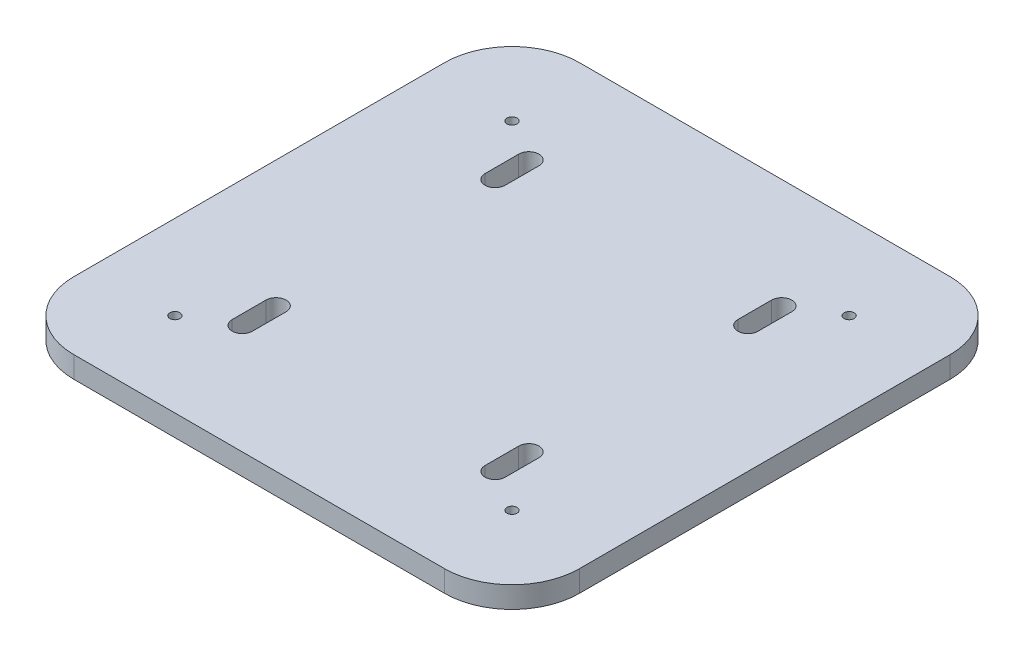
ISO-10303-21;
HEADER;
FILE_DESCRIPTION(('STEP AP214'),'2;1');
FILE_NAME('part.step','',(''),(''),'','','');
FILE_SCHEMA(('AUTOMOTIVE_DESIGN { 1 0 10303 214 1 1 1 1 }'));
ENDSEC;
DATA;
#1=APPLICATION_CONTEXT('core data for automotive mechanical design processes');
#2=APPLICATION_PROTOCOL_DEFINITION('international standard','automotive_design',2000,#1);
#3=PRODUCT_CONTEXT('',#1,'mechanical');
#4=PRODUCT('Part','Part','',(#3));
#5=PRODUCT_RELATED_PRODUCT_CATEGORY('part','',(#4));
#6=PRODUCT_DEFINITION_FORMATION('','',#4);
#7=PRODUCT_DEFINITION_CONTEXT('part definition',#1,'design');
#8=PRODUCT_DEFINITION('design','',#6,#7);
#9=PRODUCT_DEFINITION_SHAPE('','',#8);
#10=(LENGTH_UNIT() NAMED_UNIT(*) SI_UNIT(.MILLI.,.METRE.));
#11=(NAMED_UNIT(*) PLANE_ANGLE_UNIT() SI_UNIT($,.RADIAN.));
#12=(NAMED_UNIT(*) SI_UNIT($,.STERADIAN.) SOLID_ANGLE_UNIT());
#13=UNCERTAINTY_MEASURE_WITH_UNIT(LENGTH_MEASURE(1.E-05),#10,'distance_accuracy_value','');
#14=(GEOMETRIC_REPRESENTATION_CONTEXT(3) GLOBAL_UNCERTAINTY_ASSIGNED_CONTEXT((#13)) GLOBAL_UNIT_ASSIGNED_CONTEXT((#10,
#11,#12)) REPRESENTATION_CONTEXT('',''));
#15=CARTESIAN_POINT('',(0.,0.,0.));
#16=DIRECTION('',(0.,0.,1.));
#17=DIRECTION('',(1.,0.,0.));
#18=AXIS2_PLACEMENT_3D('',#15,#16,#17);
#19=CARTESIAN_POINT('',(55.,6.35,-55.));
#20=DIRECTION('',(0.,1.,0.));
#21=DIRECTION('',(0.,0.,1.));
#22=AXIS2_PLACEMENT_3D('',#19,#20,#21);
#23=PLANE('',#22);
#24=CARTESIAN_POINT('',(-37.5,6.35,42.5));
#25=DIRECTION('',(0.,1.,0.));
#26=DIRECTION('',(0.,0.,-1.));
#27=AXIS2_PLACEMENT_3D('',#24,#25,#26);
#28=CIRCLE('',#27,3.00000000000001);
#29=CARTESIAN_POINT('',(-40.5,6.35,42.5));
#30=VERTEX_POINT('',#29);
#31=CARTESIAN_POINT('',(-34.5,6.35,42.5));
#32=VERTEX_POINT('',#31);
#33=EDGE_CURVE('E48',#30,#32,#28,.T.);
#34=ORIENTED_EDGE('',*,*,#33,.F.);
#35=DIRECTION('',(0.,0.,1.));
#36=VECTOR('',#35,1.);
#37=CARTESIAN_POINT('',(-40.5,6.35,42.5));
#38=LINE('',#37,#36);
#39=CARTESIAN_POINT('',(-40.5,6.35,32.5));
#40=VERTEX_POINT('',#39);
#41=EDGE_CURVE('E257',#40,#30,#38,.T.);
#42=ORIENTED_EDGE('',*,*,#41,.F.);
#43=CARTESIAN_POINT('',(-37.5,6.35,32.5));
#44=DIRECTION('',(0.,1.,0.));
#45=DIRECTION('',(0.,0.,-1.));
#46=AXIS2_PLACEMENT_3D('',#43,#44,#45);
#47=CIRCLE('',#46,3.00000000000001);
#48=CARTESIAN_POINT('',(-34.5,6.35,32.5));
#49=VERTEX_POINT('',#48);
#50=EDGE_CURVE('E254',#49,#40,#47,.T.);
#51=ORIENTED_EDGE('',*,*,#50,.F.);
#52=DIRECTION('',(0.,0.,-1.));
#53=VECTOR('',#52,1.);
#54=CARTESIAN_POINT('',(-34.5,6.35,42.5));
#55=LINE('',#54,#53);
#56=EDGE_CURVE('E251',#32,#49,#55,.T.);
#57=ORIENTED_EDGE('',*,*,#56,.F.);
#58=EDGE_LOOP('',(#34,#42,#51,#57));
#59=FACE_BOUND('',#58,.T.);
#60=CARTESIAN_POINT('',(37.5,6.35,32.5));
#61=DIRECTION('',(0.,1.,0.));
#62=DIRECTION('',(0.,0.,1.));
#63=AXIS2_PLACEMENT_3D('',#60,#61,#62);
#64=CIRCLE('',#63,3.00000000000001);
#65=CARTESIAN_POINT('',(40.5,6.35,32.5));
#66=VERTEX_POINT('',#65);
#67=CARTESIAN_POINT('',(34.5,6.35,32.5));
#68=VERTEX_POINT('',#67);
#69=EDGE_CURVE('E56',#66,#68,#64,.T.);
#70=ORIENTED_EDGE('',*,*,#69,.F.);
#71=DIRECTION('',(0.,0.,-1.));
#72=VECTOR('',#71,1.);
#73=CARTESIAN_POINT('',(40.5,6.35,42.5));
#74=LINE('',#73,#72);
#75=CARTESIAN_POINT('',(40.5,6.35,42.5));
#76=VERTEX_POINT('',#75);
#77=EDGE_CURVE('E239',#76,#66,#74,.T.);
#78=ORIENTED_EDGE('',*,*,#77,.F.);
#79=CARTESIAN_POINT('',(37.5,6.35,42.5));
#80=DIRECTION('',(0.,1.,0.));
#81=DIRECTION('',(0.,0.,1.));
#82=AXIS2_PLACEMENT_3D('',#79,#80,#81);
#83=CIRCLE('',#82,3.00000000000001);
#84=CARTESIAN_POINT('',(34.5,6.35,42.5));
#85=VERTEX_POINT('',#84);
#86=EDGE_CURVE('E236',#85,#76,#83,.T.);
#87=ORIENTED_EDGE('',*,*,#86,.F.);
#88=DIRECTION('',(0.,0.,1.));
#89=VECTOR('',#88,1.);
#90=CARTESIAN_POINT('',(34.5,6.35,42.5));
#91=LINE('',#90,#89);
#92=EDGE_CURVE('E232',#68,#85,#91,.T.);
#93=ORIENTED_EDGE('',*,*,#92,.F.);
#94=EDGE_LOOP('',(#70,#78,#87,#93));
#95=FACE_BOUND('',#94,.T.);
#96=CARTESIAN_POINT('',(37.5,6.35,-42.5));
#97=DIRECTION('',(0.,1.,0.));
#98=DIRECTION('',(0.,0.,-1.));
#99=AXIS2_PLACEMENT_3D('',#96,#97,#98);
#100=CIRCLE('',#99,3.00000000000001);
#101=CARTESIAN_POINT('',(40.5,6.35,-42.5));
#102=VERTEX_POINT('',#101);
#103=CARTESIAN_POINT('',(34.5,6.35,-42.5));
#104=VERTEX_POINT('',#103);
#105=EDGE_CURVE('E217',#102,#104,#100,.T.);
#106=ORIENTED_EDGE('',*,*,#105,.F.);
#107=DIRECTION('',(0.,0.,-1.));
#108=VECTOR('',#107,1.);
#109=CARTESIAN_POINT('',(40.5,6.35,-42.5));
#110=LINE('',#109,#108);
#111=CARTESIAN_POINT('',(40.5,6.35,-32.5));
#112=VERTEX_POINT('',#111);
#113=EDGE_CURVE('E221',#112,#102,#110,.T.);
#114=ORIENTED_EDGE('',*,*,#113,.F.);
#115=CARTESIAN_POINT('',(37.5,6.35,-32.5));
#116=DIRECTION('',(0.,1.,0.));
#117=DIRECTION('',(0.,0.,-1.));
#118=AXIS2_PLACEMENT_3D('',#115,#116,#117);
#119=CIRCLE('',#118,3.00000000000001);
#120=CARTESIAN_POINT('',(34.5,6.35,-32.5));
#121=VERTEX_POINT('',#120);
#122=EDGE_CURVE('E201',#121,#112,#119,.T.);
#123=ORIENTED_EDGE('',*,*,#122,.F.);
#124=DIRECTION('',(0.,0.,1.));
#125=VECTOR('',#124,1.);
#126=CARTESIAN_POINT('',(34.5,6.35,-42.5));
#127=LINE('',#126,#125);
#128=EDGE_CURVE('E212',#104,#121,#127,.T.);
#129=ORIENTED_EDGE('',*,*,#128,.F.);
#130=EDGE_LOOP('',(#106,#114,#123,#129));
#131=FACE_BOUND('',#130,.T.);
#132=CARTESIAN_POINT('',(-37.5,6.35,-42.5));
#133=DIRECTION('',(0.,1.,0.));
#134=DIRECTION('',(0.,0.,1.));
#135=AXIS2_PLACEMENT_3D('',#132,#133,#134);
#136=CIRCLE('',#135,3.00000000000001);
#137=CARTESIAN_POINT('',(-34.5,6.35,-42.5));
#138=VERTEX_POINT('',#137);
#139=CARTESIAN_POINT('',(-40.5,6.35,-42.5));
#140=VERTEX_POINT('',#139);
#141=EDGE_CURVE('E228',#138,#140,#136,.T.);
#142=ORIENTED_EDGE('',*,*,#141,.F.);
#143=DIRECTION('',(0.,0.,-1.));
#144=VECTOR('',#143,1.);
#145=CARTESIAN_POINT('',(-34.5,6.35,-42.5));
#146=LINE('',#145,#144);
#147=CARTESIAN_POINT('',(-34.5,6.35,-32.5));
#148=VERTEX_POINT('',#147);
#149=EDGE_CURVE('E274',#148,#138,#146,.T.);
#150=ORIENTED_EDGE('',*,*,#149,.F.);
#151=CARTESIAN_POINT('',(-37.5,6.35,-32.5));
#152=DIRECTION('',(0.,1.,0.));
#153=DIRECTION('',(0.,0.,1.));
#154=AXIS2_PLACEMENT_3D('',#151,#152,#153);
#155=CIRCLE('',#154,3.00000000000001);
#156=CARTESIAN_POINT('',(-40.5,6.35,-32.5));
#157=VERTEX_POINT('',#156);
#158=EDGE_CURVE('E271',#157,#148,#155,.T.);
#159=ORIENTED_EDGE('',*,*,#158,.F.);
#160=DIRECTION('',(0.,0.,1.));
#161=VECTOR('',#160,1.);
#162=CARTESIAN_POINT('',(-40.5,6.35,-42.5));
#163=LINE('',#162,#161);
#164=EDGE_CURVE('E268',#140,#157,#163,.T.);
#165=ORIENTED_EDGE('',*,*,#164,.F.);
#166=EDGE_LOOP('',(#142,#150,#159,#165));
#167=FACE_BOUND('',#166,.T.);
#168=CARTESIAN_POINT('',(-49.9999999999972,6.35,50.0000000000028));
#169=DIRECTION('',(0.,1.,0.));
#170=DIRECTION('',(0.,0.,1.));
#171=AXIS2_PLACEMENT_3D('',#168,#169,#170);
#172=CIRCLE('',#171,1.5000000000021);
#173=CARTESIAN_POINT('',(-49.9999999999972,6.35,51.5000000000049));
#174=VERTEX_POINT('',#173);
#175=EDGE_CURVE('E293',#174,#174,#172,.T.);
#176=ORIENTED_EDGE('',*,*,#175,.F.);
#177=EDGE_LOOP('',(#176));
#178=FACE_BOUND('',#177,.T.);
#179=CARTESIAN_POINT('',(50.,6.35,-50.));
#180=DIRECTION('',(0.,1.,0.));
#181=DIRECTION('',(0.,0.,1.));
#182=AXIS2_PLACEMENT_3D('',#179,#180,#181);
#183=CIRCLE('',#182,1.5);
#184=CARTESIAN_POINT('',(50.,6.35,-48.5));
#185=VERTEX_POINT('',#184);
#186=EDGE_CURVE('E305',#185,#185,#183,.T.);
#187=ORIENTED_EDGE('',*,*,#186,.F.);
#188=EDGE_LOOP('',(#187));
#189=FACE_BOUND('',#188,.T.);
#190=CARTESIAN_POINT('',(55.,6.35,-55.));
#191=DIRECTION('',(0.,1.,0.));
#192=DIRECTION('',(0.,0.,1.));
#193=AXIS2_PLACEMENT_3D('',#190,#191,#192);
#194=CIRCLE('',#193,20.);
#195=CARTESIAN_POINT('',(75.,6.35,-54.9999999999999));
#196=VERTEX_POINT('',#195);
#197=CARTESIAN_POINT('',(54.9999999999998,6.35,-75.));
#198=VERTEX_POINT('',#197);
#199=EDGE_CURVE('E311',#196,#198,#194,.T.);
#200=ORIENTED_EDGE('',*,*,#199,.T.);
#201=DIRECTION('',(-1.,0.,0.));
#202=VECTOR('',#201,1.);
#203=CARTESIAN_POINT('',(-54.9999999999998,6.35,-75.));
#204=LINE('',#203,#202);
#205=CARTESIAN_POINT('',(-55.,6.35,-75.));
#206=VERTEX_POINT('',#205);
#207=EDGE_CURVE('E314',#198,#206,#204,.T.);
#208=ORIENTED_EDGE('',*,*,#207,.T.);
#209=CARTESIAN_POINT('',(-55.,6.35,-55.));
#210=DIRECTION('',(0.,1.,0.));
#211=DIRECTION('',(0.,0.,-1.));
#212=AXIS2_PLACEMENT_3D('',#209,#210,#211);
#213=CIRCLE('',#212,20.);
#214=CARTESIAN_POINT('',(-75.,6.35,-54.9999999999999));
#215=VERTEX_POINT('',#214);
#216=EDGE_CURVE('E317',#206,#215,#213,.T.);
#217=ORIENTED_EDGE('',*,*,#216,.T.);
#218=DIRECTION('',(0.,0.,1.));
#219=VECTOR('',#218,1.);
#220=CARTESIAN_POINT('',(-75.,6.35,-54.9999999999999));
#221=LINE('',#220,#219);
#222=CARTESIAN_POINT('',(-75.,6.35,54.9999999999999));
#223=VERTEX_POINT('',#222);
#224=EDGE_CURVE('E319',#215,#223,#221,.T.);
#225=ORIENTED_EDGE('',*,*,#224,.T.);
#226=CARTESIAN_POINT('',(-55.,6.35,55.));
#227=DIRECTION('',(0.,1.,0.));
#228=DIRECTION('',(0.,0.,1.));
#229=AXIS2_PLACEMENT_3D('',#226,#227,#228);
#230=CIRCLE('',#229,20.);
#231=CARTESIAN_POINT('',(-54.9999999999998,6.35,75.));
#232=VERTEX_POINT('',#231);
#233=EDGE_CURVE('E321',#223,#232,#230,.T.);
#234=ORIENTED_EDGE('',*,*,#233,.T.);
#235=DIRECTION('',(1.,0.,0.));
#236=VECTOR('',#235,1.);
#237=CARTESIAN_POINT('',(-54.9999999999998,6.35,75.));
#238=LINE('',#237,#236);
#239=CARTESIAN_POINT('',(54.9999999999999,6.35,75.));
#240=VERTEX_POINT('',#239);
#241=EDGE_CURVE('E323',#232,#240,#238,.T.);
#242=ORIENTED_EDGE('',*,*,#241,.T.);
#243=CARTESIAN_POINT('',(55.,6.35,55.));
#244=DIRECTION('',(0.,1.,0.));
#245=DIRECTION('',(0.,0.,-1.));
#246=AXIS2_PLACEMENT_3D('',#243,#244,#245);
#247=CIRCLE('',#246,20.);
#248=CARTESIAN_POINT('',(75.,6.35,54.9999999999999));
#249=VERTEX_POINT('',#248);
#250=EDGE_CURVE('E325',#240,#249,#247,.T.);
#251=ORIENTED_EDGE('',*,*,#250,.T.);
#252=DIRECTION('',(0.,0.,-1.));
#253=VECTOR('',#252,1.);
#254=CARTESIAN_POINT('',(75.,6.35,-54.9999999999999));
#255=LINE('',#254,#253);
#256=EDGE_CURVE('E327',#249,#196,#255,.T.);
#257=ORIENTED_EDGE('',*,*,#256,.T.);
#258=EDGE_LOOP('',(#200,#208,#217,#225,#234,#242,#251,#257));
#259=FACE_BOUND('',#258,.T.);
#260=CARTESIAN_POINT('',(50.0000000000028,6.35,50.));
#261=DIRECTION('',(0.,1.,0.));
#262=DIRECTION('',(0.,0.,1.));
#263=AXIS2_PLACEMENT_3D('',#260,#261,#262);
#264=CIRCLE('',#263,1.49999999999931);
#265=CARTESIAN_POINT('',(50.0000000000028,6.35,51.4999999999993));
#266=VERTEX_POINT('',#265);
#267=EDGE_CURVE('E299',#266,#266,#264,.T.);
#268=ORIENTED_EDGE('',*,*,#267,.F.);
#269=EDGE_LOOP('',(#268));
#270=FACE_BOUND('',#269,.T.);
#271=CARTESIAN_POINT('',(-50.,6.35,-49.9999999999972));
#272=DIRECTION('',(0.,1.,0.));
#273=DIRECTION('',(0.,0.,1.));
#274=AXIS2_PLACEMENT_3D('',#271,#272,#273);
#275=CIRCLE('',#274,1.50000000000302);
#276=CARTESIAN_POINT('',(-50.,6.35,-48.4999999999942));
#277=VERTEX_POINT('',#276);
#278=EDGE_CURVE('E287',#277,#277,#275,.T.);
#279=ORIENTED_EDGE('',*,*,#278,.F.);
#280=EDGE_LOOP('',(#279));
#281=FACE_BOUND('',#280,.T.);
#282=ADVANCED_FACE('F33',(#59,#95,#131,#167,#178,#189,#259,#270,#281),#23,.T.);
#283=CARTESIAN_POINT('',(55.,0.,-55.));
#284=DIRECTION('',(0.,1.,0.));
#285=DIRECTION('',(0.,0.,1.));
#286=AXIS2_PLACEMENT_3D('',#283,#284,#285);
#287=PLANE('',#286);
#288=DIRECTION('',(0.,0.,1.));
#289=VECTOR('',#288,1.);
#290=CARTESIAN_POINT('',(-40.5000000000001,0.,-54.9999999999999));
#291=LINE('',#290,#289);
#292=CARTESIAN_POINT('',(-40.5,0.,32.5));
#293=VERTEX_POINT('',#292);
#294=CARTESIAN_POINT('',(-40.5,0.,42.5));
#295=VERTEX_POINT('',#294);
#296=EDGE_CURVE('E41',#293,#295,#291,.T.);
#297=ORIENTED_EDGE('',*,*,#296,.T.);
#298=CARTESIAN_POINT('',(-37.5,0.,42.5));
#299=DIRECTION('',(0.,1.,0.));
#300=DIRECTION('',(0.,0.,1.));
#301=AXIS2_PLACEMENT_3D('',#298,#299,#300);
#302=CIRCLE('',#301,3.00000000000001);
#303=CARTESIAN_POINT('',(-34.5,0.,42.5));
#304=VERTEX_POINT('',#303);
#305=EDGE_CURVE('E11',#295,#304,#302,.T.);
#306=ORIENTED_EDGE('',*,*,#305,.T.);
#307=DIRECTION('',(0.,0.,-1.));
#308=VECTOR('',#307,1.);
#309=CARTESIAN_POINT('',(-34.5,0.,-55.));
#310=LINE('',#309,#308);
#311=CARTESIAN_POINT('',(-34.5,0.,32.5));
#312=VERTEX_POINT('',#311);
#313=EDGE_CURVE('E401',#304,#312,#310,.T.);
#314=ORIENTED_EDGE('',*,*,#313,.T.);
#315=CARTESIAN_POINT('',(-37.5,0.,32.5));
#316=DIRECTION('',(0.,1.,0.));
#317=DIRECTION('',(0.,0.,1.));
#318=AXIS2_PLACEMENT_3D('',#315,#316,#317);
#319=CIRCLE('',#318,3.00000000000001);
#320=EDGE_CURVE('E404',#312,#293,#319,.T.);
#321=ORIENTED_EDGE('',*,*,#320,.T.);
#322=EDGE_LOOP('',(#297,#306,#314,#321));
#323=FACE_BOUND('',#322,.T.);
#324=DIRECTION('',(0.,0.,-1.));
#325=VECTOR('',#324,1.);
#326=CARTESIAN_POINT('',(40.5000000000001,0.,-55.));
#327=LINE('',#326,#325);
#328=CARTESIAN_POINT('',(40.5,0.,42.5));
#329=VERTEX_POINT('',#328);
#330=CARTESIAN_POINT('',(40.5,0.,32.5));
#331=VERTEX_POINT('',#330);
#332=EDGE_CURVE('E395',#329,#331,#327,.T.);
#333=ORIENTED_EDGE('',*,*,#332,.T.);
#334=CARTESIAN_POINT('',(37.5,0.,32.5));
#335=DIRECTION('',(0.,1.,0.));
#336=DIRECTION('',(0.,0.,1.));
#337=AXIS2_PLACEMENT_3D('',#334,#335,#336);
#338=CIRCLE('',#337,3.00000000000001);
#339=CARTESIAN_POINT('',(34.5,0.,32.5));
#340=VERTEX_POINT('',#339);
#341=EDGE_CURVE('E398',#331,#340,#338,.T.);
#342=ORIENTED_EDGE('',*,*,#341,.T.);
#343=DIRECTION('',(0.,0.,1.));
#344=VECTOR('',#343,1.);
#345=CARTESIAN_POINT('',(34.5,0.,-55.));
#346=LINE('',#345,#344);
#347=CARTESIAN_POINT('',(34.5,0.,42.5));
#348=VERTEX_POINT('',#347);
#349=EDGE_CURVE('E389',#340,#348,#346,.T.);
#350=ORIENTED_EDGE('',*,*,#349,.T.);
#351=CARTESIAN_POINT('',(37.5,0.,42.5));
#352=DIRECTION('',(0.,1.,0.));
#353=DIRECTION('',(0.,0.,1.));
#354=AXIS2_PLACEMENT_3D('',#351,#352,#353);
#355=CIRCLE('',#354,3.00000000000001);
#356=EDGE_CURVE('E392',#348,#329,#355,.T.);
#357=ORIENTED_EDGE('',*,*,#356,.T.);
#358=EDGE_LOOP('',(#333,#342,#350,#357));
#359=FACE_BOUND('',#358,.T.);
#360=DIRECTION('',(0.,0.,-1.));
#361=VECTOR('',#360,1.);
#362=CARTESIAN_POINT('',(40.5,0.,-55.));
#363=LINE('',#362,#361);
#364=CARTESIAN_POINT('',(40.5,0.,-32.5));
#365=VERTEX_POINT('',#364);
#366=CARTESIAN_POINT('',(40.5,0.,-42.5));
#367=VERTEX_POINT('',#366);
#368=EDGE_CURVE('E383',#365,#367,#363,.T.);
#369=ORIENTED_EDGE('',*,*,#368,.T.);
#370=CARTESIAN_POINT('',(37.5,0.,-42.5));
#371=DIRECTION('',(0.,1.,0.));
#372=DIRECTION('',(0.,0.,1.));
#373=AXIS2_PLACEMENT_3D('',#370,#371,#372);
#374=CIRCLE('',#373,3.00000000000001);
#375=CARTESIAN_POINT('',(34.5,0.,-42.5));
#376=VERTEX_POINT('',#375);
#377=EDGE_CURVE('E386',#367,#376,#374,.T.);
#378=ORIENTED_EDGE('',*,*,#377,.T.);
#379=DIRECTION('',(0.,0.,1.));
#380=VECTOR('',#379,1.);
#381=CARTESIAN_POINT('',(34.5,0.,-55.));
#382=LINE('',#381,#380);
#383=CARTESIAN_POINT('',(34.5,0.,-32.5));
#384=VERTEX_POINT('',#383);
#385=EDGE_CURVE('E380',#376,#384,#382,.T.);
#386=ORIENTED_EDGE('',*,*,#385,.T.);
#387=CARTESIAN_POINT('',(37.5,0.,-32.5));
#388=DIRECTION('',(0.,1.,0.));
#389=DIRECTION('',(0.,0.,1.));
#390=AXIS2_PLACEMENT_3D('',#387,#388,#389);
#391=CIRCLE('',#390,3.00000000000001);
#392=EDGE_CURVE('E204',#384,#365,#391,.T.);
#393=ORIENTED_EDGE('',*,*,#392,.T.);
#394=EDGE_LOOP('',(#369,#378,#386,#393));
#395=FACE_BOUND('',#394,.T.);
#396=DIRECTION('',(0.,0.,-1.));
#397=VECTOR('',#396,1.);
#398=CARTESIAN_POINT('',(-34.5,0.,-55.));
#399=LINE('',#398,#397);
#400=CARTESIAN_POINT('',(-34.5,0.,-32.5));
#401=VERTEX_POINT('',#400);
#402=CARTESIAN_POINT('',(-34.5,0.,-42.5));
#403=VERTEX_POINT('',#402);
#404=EDGE_CURVE('E374',#401,#403,#399,.T.);
#405=ORIENTED_EDGE('',*,*,#404,.T.);
#406=CARTESIAN_POINT('',(-37.5,0.,-42.5));
#407=DIRECTION('',(0.,1.,0.));
#408=DIRECTION('',(0.,0.,1.));
#409=AXIS2_PLACEMENT_3D('',#406,#407,#408);
#410=CIRCLE('',#409,3.00000000000001);
#411=CARTESIAN_POINT('',(-40.5,0.,-42.5));
#412=VERTEX_POINT('',#411);
#413=EDGE_CURVE('E377',#403,#412,#410,.T.);
#414=ORIENTED_EDGE('',*,*,#413,.T.);
#415=DIRECTION('',(0.,0.,1.));
#416=VECTOR('',#415,1.);
#417=CARTESIAN_POINT('',(-40.5,0.,-55.0000000000001));
#418=LINE('',#417,#416);
#419=CARTESIAN_POINT('',(-40.5,0.,-32.5));
#420=VERTEX_POINT('',#419);
#421=EDGE_CURVE('E368',#412,#420,#418,.T.);
#422=ORIENTED_EDGE('',*,*,#421,.T.);
#423=CARTESIAN_POINT('',(-37.5,0.,-32.5));
#424=DIRECTION('',(0.,1.,0.));
#425=DIRECTION('',(0.,0.,1.));
#426=AXIS2_PLACEMENT_3D('',#423,#424,#425);
#427=CIRCLE('',#426,3.00000000000001);
#428=EDGE_CURVE('E371',#420,#401,#427,.T.);
#429=ORIENTED_EDGE('',*,*,#428,.T.);
#430=EDGE_LOOP('',(#405,#414,#422,#429));
#431=FACE_BOUND('',#430,.T.);
#432=CARTESIAN_POINT('',(55.,0.,-55.));
#433=DIRECTION('',(0.,1.,0.));
#434=DIRECTION('',(0.,0.,1.));
#435=AXIS2_PLACEMENT_3D('',#432,#433,#434);
#436=CIRCLE('',#435,20.);
#437=CARTESIAN_POINT('',(75.,0.,-54.9999999999999));
#438=VERTEX_POINT('',#437);
#439=CARTESIAN_POINT('',(54.9999999999998,0.,-75.));
#440=VERTEX_POINT('',#439);
#441=EDGE_CURVE('E308',#438,#440,#436,.T.);
#442=ORIENTED_EDGE('',*,*,#441,.F.);
#443=DIRECTION('',(0.,0.,-1.));
#444=VECTOR('',#443,1.);
#445=CARTESIAN_POINT('',(75.,0.,-54.9999999999999));
#446=LINE('',#445,#444);
#447=CARTESIAN_POINT('',(75.,0.,54.9999999999999));
#448=VERTEX_POINT('',#447);
#449=EDGE_CURVE('E315',#448,#438,#446,.T.);
#450=ORIENTED_EDGE('',*,*,#449,.F.);
#451=CARTESIAN_POINT('',(55.,0.,55.));
#452=DIRECTION('',(0.,1.,0.));
#453=DIRECTION('',(0.,0.,-1.));
#454=AXIS2_PLACEMENT_3D('',#451,#452,#453);
#455=CIRCLE('',#454,20.);
#456=CARTESIAN_POINT('',(54.9999999999999,0.,75.));
#457=VERTEX_POINT('',#456);
#458=EDGE_CURVE('E342',#457,#448,#455,.T.);
#459=ORIENTED_EDGE('',*,*,#458,.F.);
#460=DIRECTION('',(1.,0.,0.));
#461=VECTOR('',#460,1.);
#462=CARTESIAN_POINT('',(-54.9999999999998,0.,75.));
#463=LINE('',#462,#461);
#464=CARTESIAN_POINT('',(-54.9999999999998,0.,75.));
#465=VERTEX_POINT('',#464);
#466=EDGE_CURVE('E340',#465,#457,#463,.T.);
#467=ORIENTED_EDGE('',*,*,#466,.F.);
#468=CARTESIAN_POINT('',(-55.,0.,55.));
#469=DIRECTION('',(0.,1.,0.));
#470=DIRECTION('',(0.,0.,1.));
#471=AXIS2_PLACEMENT_3D('',#468,#469,#470);
#472=CIRCLE('',#471,20.);
#473=CARTESIAN_POINT('',(-75.,0.,54.9999999999999));
#474=VERTEX_POINT('',#473);
#475=EDGE_CURVE('E338',#474,#465,#472,.T.);
#476=ORIENTED_EDGE('',*,*,#475,.F.);
#477=DIRECTION('',(0.,0.,1.));
#478=VECTOR('',#477,1.);
#479=CARTESIAN_POINT('',(-75.,0.,-54.9999999999999));
#480=LINE('',#479,#478);
#481=CARTESIAN_POINT('',(-75.,0.,-54.9999999999999));
#482=VERTEX_POINT('',#481);
#483=EDGE_CURVE('E336',#482,#474,#480,.T.);
#484=ORIENTED_EDGE('',*,*,#483,.F.);
#485=CARTESIAN_POINT('',(-55.,0.,-55.));
#486=DIRECTION('',(0.,1.,0.));
#487=DIRECTION('',(0.,0.,-1.));
#488=AXIS2_PLACEMENT_3D('',#485,#486,#487);
#489=CIRCLE('',#488,20.);
#490=CARTESIAN_POINT('',(-55.,0.,-75.));
#491=VERTEX_POINT('',#490);
#492=EDGE_CURVE('E334',#491,#482,#489,.T.);
#493=ORIENTED_EDGE('',*,*,#492,.F.);
#494=DIRECTION('',(-1.,0.,0.));
#495=VECTOR('',#494,1.);
#496=CARTESIAN_POINT('',(-54.9999999999998,0.,-75.));
#497=LINE('',#496,#495);
#498=EDGE_CURVE('E332',#440,#491,#497,.T.);
#499=ORIENTED_EDGE('',*,*,#498,.F.);
#500=EDGE_LOOP('',(#442,#450,#459,#467,#476,#484,#493,#499));
#501=FACE_BOUND('',#500,.T.);
#502=CARTESIAN_POINT('',(50.,0.,-50.));
#503=DIRECTION('',(0.,1.,0.));
#504=DIRECTION('',(0.,0.,1.));
#505=AXIS2_PLACEMENT_3D('',#502,#503,#504);
#506=CIRCLE('',#505,1.5);
#507=CARTESIAN_POINT('',(50.,0.,-48.5));
#508=VERTEX_POINT('',#507);
#509=EDGE_CURVE('E302',#508,#508,#506,.T.);
#510=ORIENTED_EDGE('',*,*,#509,.T.);
#511=EDGE_LOOP('',(#510));
#512=FACE_BOUND('',#511,.T.);
#513=CARTESIAN_POINT('',(50.0000000000028,0.,50.));
#514=DIRECTION('',(0.,1.,0.));
#515=DIRECTION('',(0.,0.,1.));
#516=AXIS2_PLACEMENT_3D('',#513,#514,#515);
#517=CIRCLE('',#516,1.49999999999931);
#518=CARTESIAN_POINT('',(50.0000000000028,0.,51.4999999999993));
#519=VERTEX_POINT('',#518);
#520=EDGE_CURVE('E296',#519,#519,#517,.T.);
#521=ORIENTED_EDGE('',*,*,#520,.T.);
#522=EDGE_LOOP('',(#521));
#523=FACE_BOUND('',#522,.T.);
#524=CARTESIAN_POINT('',(-49.9999999999972,0.,50.0000000000028));
#525=DIRECTION('',(0.,1.,0.));
#526=DIRECTION('',(0.,0.,1.));
#527=AXIS2_PLACEMENT_3D('',#524,#525,#526);
#528=CIRCLE('',#527,1.5000000000021);
#529=CARTESIAN_POINT('',(-49.9999999999972,0.,51.5000000000049));
#530=VERTEX_POINT('',#529);
#531=EDGE_CURVE('E290',#530,#530,#528,.T.);
#532=ORIENTED_EDGE('',*,*,#531,.T.);
#533=EDGE_LOOP('',(#532));
#534=FACE_BOUND('',#533,.T.);
#535=CARTESIAN_POINT('',(-50.,0.,-49.9999999999972));
#536=DIRECTION('',(0.,1.,0.));
#537=DIRECTION('',(0.,0.,1.));
#538=AXIS2_PLACEMENT_3D('',#535,#536,#537);
#539=CIRCLE('',#538,1.50000000000302);
#540=CARTESIAN_POINT('',(-50.,0.,-48.4999999999942));
#541=VERTEX_POINT('',#540);
#542=EDGE_CURVE('E280',#541,#541,#539,.T.);
#543=ORIENTED_EDGE('',*,*,#542,.T.);
#544=EDGE_LOOP('',(#543));
#545=FACE_BOUND('',#544,.T.);
#546=ADVANCED_FACE('F408',(#323,#359,#395,#431,#501,#512,#523,#534,#545),#287,.F.);
#547=CARTESIAN_POINT('',(55.,6.35,-55.));
#548=DIRECTION('',(0.,-1.,0.));
#549=DIRECTION('',(0.,0.,-1.));
#550=AXIS2_PLACEMENT_3D('',#547,#548,#549);
#551=CYLINDRICAL_SURFACE('',#550,20.);
#552=ORIENTED_EDGE('',*,*,#441,.T.);
#553=DIRECTION('',(0.,-1.,0.));
#554=VECTOR('',#553,1.);
#555=CARTESIAN_POINT('',(54.9999999999998,6.35,-75.));
#556=LINE('',#555,#554);
#557=EDGE_CURVE('E365',#198,#440,#556,.T.);
#558=ORIENTED_EDGE('',*,*,#557,.F.);
#559=ORIENTED_EDGE('',*,*,#199,.F.);
#560=DIRECTION('',(0.,-1.,0.));
#561=VECTOR('',#560,1.);
#562=CARTESIAN_POINT('',(75.,6.35,-54.9999999999999));
#563=LINE('',#562,#561);
#564=EDGE_CURVE('E329',#196,#438,#563,.T.);
#565=ORIENTED_EDGE('',*,*,#564,.T.);
#566=EDGE_LOOP('',(#552,#558,#559,#565));
#567=FACE_BOUND('',#566,.T.);
#568=ADVANCED_FACE('F35',(#567),#551,.T.);
#569=CARTESIAN_POINT('',(-54.9999999999998,6.35,-75.));
#570=DIRECTION('',(0.,0.,1.));
#571=DIRECTION('',(1.,0.,0.));
#572=AXIS2_PLACEMENT_3D('',#569,#570,#571);
#573=PLANE('',#572);
#574=ORIENTED_EDGE('',*,*,#498,.T.);
#575=DIRECTION('',(0.,-1.,0.));
#576=VECTOR('',#575,1.);
#577=CARTESIAN_POINT('',(-55.,6.35,-75.));
#578=LINE('',#577,#576);
#579=EDGE_CURVE('E362',#206,#491,#578,.T.);
#580=ORIENTED_EDGE('',*,*,#579,.F.);
#581=ORIENTED_EDGE('',*,*,#207,.F.);
#582=ORIENTED_EDGE('',*,*,#557,.T.);
#583=EDGE_LOOP('',(#574,#580,#581,#582));
#584=FACE_BOUND('',#583,.T.);
#585=ADVANCED_FACE('F470',(#584),#573,.F.);
#586=CARTESIAN_POINT('',(-55.,6.35,-55.));
#587=DIRECTION('',(0.,-1.,0.));
#588=DIRECTION('',(0.,0.,-1.));
#589=AXIS2_PLACEMENT_3D('',#586,#587,#588);
#590=CYLINDRICAL_SURFACE('',#589,20.);
#591=ORIENTED_EDGE('',*,*,#492,.T.);
#592=DIRECTION('',(0.,-1.,0.));
#593=VECTOR('',#592,1.);
#594=CARTESIAN_POINT('',(-75.,6.35,-54.9999999999999));
#595=LINE('',#594,#593);
#596=EDGE_CURVE('E359',#215,#482,#595,.T.);
#597=ORIENTED_EDGE('',*,*,#596,.F.);
#598=ORIENTED_EDGE('',*,*,#216,.F.);
#599=ORIENTED_EDGE('',*,*,#579,.T.);
#600=EDGE_LOOP('',(#591,#597,#598,#599));
#601=FACE_BOUND('',#600,.T.);
#602=ADVANCED_FACE('F467',(#601),#590,.T.);
#603=CARTESIAN_POINT('',(-75.,6.35,-54.9999999999999));
#604=DIRECTION('',(1.,0.,0.));
#605=DIRECTION('',(0.,0.,-1.));
#606=AXIS2_PLACEMENT_3D('',#603,#604,#605);
#607=PLANE('',#606);
#608=ORIENTED_EDGE('',*,*,#483,.T.);
#609=DIRECTION('',(0.,-1.,0.));
#610=VECTOR('',#609,1.);
#611=CARTESIAN_POINT('',(-75.,6.35,54.9999999999999));
#612=LINE('',#611,#610);
#613=EDGE_CURVE('E356',#223,#474,#612,.T.);
#614=ORIENTED_EDGE('',*,*,#613,.F.);
#615=ORIENTED_EDGE('',*,*,#224,.F.);
#616=ORIENTED_EDGE('',*,*,#596,.T.);
#617=EDGE_LOOP('',(#608,#614,#615,#616));
#618=FACE_BOUND('',#617,.T.);
#619=ADVANCED_FACE('F463',(#618),#607,.F.);
#620=CARTESIAN_POINT('',(-55.,6.35,55.));
#621=DIRECTION('',(0.,-1.,0.));
#622=DIRECTION('',(0.,0.,-1.));
#623=AXIS2_PLACEMENT_3D('',#620,#621,#622);
#624=CYLINDRICAL_SURFACE('',#623,20.);
#625=ORIENTED_EDGE('',*,*,#475,.T.);
#626=DIRECTION('',(0.,-1.,0.));
#627=VECTOR('',#626,1.);
#628=CARTESIAN_POINT('',(-54.9999999999998,6.35,75.));
#629=LINE('',#628,#627);
#630=EDGE_CURVE('E353',#232,#465,#629,.T.);
#631=ORIENTED_EDGE('',*,*,#630,.F.);
#632=ORIENTED_EDGE('',*,*,#233,.F.);
#633=ORIENTED_EDGE('',*,*,#613,.T.);
#634=EDGE_LOOP('',(#625,#631,#632,#633));
#635=FACE_BOUND('',#634,.T.);
#636=ADVANCED_FACE('F459',(#635),#624,.T.);
#637=CARTESIAN_POINT('',(-54.9999999999998,6.35,75.));
#638=DIRECTION('',(0.,0.,-1.));
#639=DIRECTION('',(-1.,0.,0.));
#640=AXIS2_PLACEMENT_3D('',#637,#638,#639);
#641=PLANE('',#640);
#642=ORIENTED_EDGE('',*,*,#466,.T.);
#643=DIRECTION('',(0.,-1.,0.));
#644=VECTOR('',#643,1.);
#645=CARTESIAN_POINT('',(54.9999999999999,6.35,75.));
#646=LINE('',#645,#644);
#647=EDGE_CURVE('E350',#240,#457,#646,.T.);
#648=ORIENTED_EDGE('',*,*,#647,.F.);
#649=ORIENTED_EDGE('',*,*,#241,.F.);
#650=ORIENTED_EDGE('',*,*,#630,.T.);
#651=EDGE_LOOP('',(#642,#648,#649,#650));
#652=FACE_BOUND('',#651,.T.);
#653=ADVANCED_FACE('F455',(#652),#641,.F.);
#654=CARTESIAN_POINT('',(55.,6.35,55.));
#655=DIRECTION('',(0.,-1.,0.));
#656=DIRECTION('',(0.,0.,-1.));
#657=AXIS2_PLACEMENT_3D('',#654,#655,#656);
#658=CYLINDRICAL_SURFACE('',#657,20.);
#659=ORIENTED_EDGE('',*,*,#458,.T.);
#660=DIRECTION('',(0.,-1.,0.));
#661=VECTOR('',#660,1.);
#662=CARTESIAN_POINT('',(75.,6.35,54.9999999999999));
#663=LINE('',#662,#661);
#664=EDGE_CURVE('E347',#249,#448,#663,.T.);
#665=ORIENTED_EDGE('',*,*,#664,.F.);
#666=ORIENTED_EDGE('',*,*,#250,.F.);
#667=ORIENTED_EDGE('',*,*,#647,.T.);
#668=EDGE_LOOP('',(#659,#665,#666,#667));
#669=FACE_BOUND('',#668,.T.);
#670=ADVANCED_FACE('F451',(#669),#658,.T.);
#671=CARTESIAN_POINT('',(75.,6.35,-54.9999999999999));
#672=DIRECTION('',(-1.,0.,0.));
#673=DIRECTION('',(0.,0.,1.));
#674=AXIS2_PLACEMENT_3D('',#671,#672,#673);
#675=PLANE('',#674);
#676=ORIENTED_EDGE('',*,*,#449,.T.);
#677=ORIENTED_EDGE('',*,*,#564,.F.);
#678=ORIENTED_EDGE('',*,*,#256,.F.);
#679=ORIENTED_EDGE('',*,*,#664,.T.);
#680=EDGE_LOOP('',(#676,#677,#678,#679));
#681=FACE_BOUND('',#680,.T.);
#682=ADVANCED_FACE('F448',(#681),#675,.F.);
#683=CARTESIAN_POINT('',(50.,6.35,-50.));
#684=DIRECTION('',(0.,-1.,0.));
#685=DIRECTION('',(0.,0.,-1.));
#686=AXIS2_PLACEMENT_3D('',#683,#684,#685);
#687=CYLINDRICAL_SURFACE('',#686,1.5);
#688=ORIENTED_EDGE('',*,*,#186,.T.);
#689=EDGE_LOOP('',(#688));
#690=FACE_BOUND('',#689,.T.);
#691=ORIENTED_EDGE('',*,*,#509,.F.);
#692=EDGE_LOOP('',(#691));
#693=FACE_BOUND('',#692,.T.);
#694=ADVANCED_FACE('F445',(#690,#693),#687,.F.);
#695=CARTESIAN_POINT('',(50.0000000000028,6.35,50.));
#696=DIRECTION('',(0.,-1.,0.));
#697=DIRECTION('',(0.,0.,-1.));
#698=AXIS2_PLACEMENT_3D('',#695,#696,#697);
#699=CYLINDRICAL_SURFACE('',#698,1.49999999999931);
#700=ORIENTED_EDGE('',*,*,#267,.T.);
#701=EDGE_LOOP('',(#700));
#702=FACE_BOUND('',#701,.T.);
#703=ORIENTED_EDGE('',*,*,#520,.F.);
#704=EDGE_LOOP('',(#703));
#705=FACE_BOUND('',#704,.T.);
#706=ADVANCED_FACE('F523',(#702,#705),#699,.F.);
#707=CARTESIAN_POINT('',(-49.9999999999972,6.35,50.0000000000028));
#708=DIRECTION('',(0.,-1.,0.));
#709=DIRECTION('',(0.,0.,-1.));
#710=AXIS2_PLACEMENT_3D('',#707,#708,#709);
#711=CYLINDRICAL_SURFACE('',#710,1.5000000000021);
#712=ORIENTED_EDGE('',*,*,#175,.T.);
#713=EDGE_LOOP('',(#712));
#714=FACE_BOUND('',#713,.T.);
#715=ORIENTED_EDGE('',*,*,#531,.F.);
#716=EDGE_LOOP('',(#715));
#717=FACE_BOUND('',#716,.T.);
#718=ADVANCED_FACE('F512',(#714,#717),#711,.F.);
#719=CARTESIAN_POINT('',(-50.,6.35,-49.9999999999972));
#720=DIRECTION('',(0.,-1.,0.));
#721=DIRECTION('',(0.,0.,-1.));
#722=AXIS2_PLACEMENT_3D('',#719,#720,#721);
#723=CYLINDRICAL_SURFACE('',#722,1.50000000000302);
#724=ORIENTED_EDGE('',*,*,#278,.T.);
#725=EDGE_LOOP('',(#724));
#726=FACE_BOUND('',#725,.T.);
#727=ORIENTED_EDGE('',*,*,#542,.F.);
#728=EDGE_LOOP('',(#727));
#729=FACE_BOUND('',#728,.T.);
#730=ADVANCED_FACE('F508',(#726,#729),#723,.F.);
#731=CARTESIAN_POINT('',(-37.5,-3.65,-42.5));
#732=DIRECTION('',(0.,1.,0.));
#733=DIRECTION('',(0.,0.,1.));
#734=AXIS2_PLACEMENT_3D('',#731,#732,#733);
#735=CYLINDRICAL_SURFACE('',#734,3.00000000000001);
#736=DIRECTION('',(0.,1.,0.));
#737=VECTOR('',#736,1.);
#738=CARTESIAN_POINT('',(-34.5,-3.65,-42.5));
#739=LINE('',#738,#737);
#740=EDGE_CURVE('E278',#403,#138,#739,.T.);
#741=ORIENTED_EDGE('',*,*,#740,.T.);
#742=ORIENTED_EDGE('',*,*,#141,.T.);
#743=DIRECTION('',(0.,1.,0.));
#744=VECTOR('',#743,1.);
#745=CARTESIAN_POINT('',(-40.5,-3.65,-42.5));
#746=LINE('',#745,#744);
#747=EDGE_CURVE('E277',#412,#140,#746,.T.);
#748=ORIENTED_EDGE('',*,*,#747,.F.);
#749=ORIENTED_EDGE('',*,*,#413,.F.);
#750=EDGE_LOOP('',(#741,#742,#748,#749));
#751=FACE_BOUND('',#750,.T.);
#752=ADVANCED_FACE('F511',(#751),#735,.F.);
#753=CARTESIAN_POINT('',(-34.5,-3.65,-42.5));
#754=DIRECTION('',(1.,0.,0.));
#755=DIRECTION('',(0.,0.,-1.));
#756=AXIS2_PLACEMENT_3D('',#753,#754,#755);
#757=PLANE('',#756);
#758=DIRECTION('',(0.,1.,0.));
#759=VECTOR('',#758,1.);
#760=CARTESIAN_POINT('',(-34.5,-3.65,-32.5));
#761=LINE('',#760,#759);
#762=EDGE_CURVE('E281',#401,#148,#761,.T.);
#763=ORIENTED_EDGE('',*,*,#762,.T.);
#764=ORIENTED_EDGE('',*,*,#149,.T.);
#765=ORIENTED_EDGE('',*,*,#740,.F.);
#766=ORIENTED_EDGE('',*,*,#404,.F.);
#767=EDGE_LOOP('',(#763,#764,#765,#766));
#768=FACE_BOUND('',#767,.T.);
#769=ADVANCED_FACE('F520',(#768),#757,.F.);
#770=CARTESIAN_POINT('',(-37.5,-3.65,-32.5));
#771=DIRECTION('',(0.,1.,0.));
#772=DIRECTION('',(0.,0.,1.));
#773=AXIS2_PLACEMENT_3D('',#770,#771,#772);
#774=CYLINDRICAL_SURFACE('',#773,3.00000000000001);
#775=DIRECTION('',(0.,1.,0.));
#776=VECTOR('',#775,1.);
#777=CARTESIAN_POINT('',(-40.5,-3.65,-32.5));
#778=LINE('',#777,#776);
#779=EDGE_CURVE('E283',#420,#157,#778,.T.);
#780=ORIENTED_EDGE('',*,*,#779,.T.);
#781=ORIENTED_EDGE('',*,*,#158,.T.);
#782=ORIENTED_EDGE('',*,*,#762,.F.);
#783=ORIENTED_EDGE('',*,*,#428,.F.);
#784=EDGE_LOOP('',(#780,#781,#782,#783));
#785=FACE_BOUND('',#784,.T.);
#786=ADVANCED_FACE('F603',(#785),#774,.F.);
#787=CARTESIAN_POINT('',(-40.5,-3.65,-42.5));
#788=DIRECTION('',(-1.,0.,0.));
#789=DIRECTION('',(0.,0.,1.));
#790=AXIS2_PLACEMENT_3D('',#787,#788,#789);
#791=PLANE('',#790);
#792=ORIENTED_EDGE('',*,*,#747,.T.);
#793=ORIENTED_EDGE('',*,*,#164,.T.);
#794=ORIENTED_EDGE('',*,*,#779,.F.);
#795=ORIENTED_EDGE('',*,*,#421,.F.);
#796=EDGE_LOOP('',(#792,#793,#794,#795));
#797=FACE_BOUND('',#796,.T.);
#798=ADVANCED_FACE('F612',(#797),#791,.F.);
#799=CARTESIAN_POINT('',(37.5,-3.65,-42.5));
#800=DIRECTION('',(0.,1.,0.));
#801=DIRECTION('',(0.,0.,1.));
#802=AXIS2_PLACEMENT_3D('',#799,#800,#801);
#803=CYLINDRICAL_SURFACE('',#802,3.00000000000001);
#804=DIRECTION('',(0.,1.,0.));
#805=VECTOR('',#804,1.);
#806=CARTESIAN_POINT('',(40.5,-3.65,-42.5));
#807=LINE('',#806,#805);
#808=EDGE_CURVE('E226',#367,#102,#807,.T.);
#809=ORIENTED_EDGE('',*,*,#808,.T.);
#810=ORIENTED_EDGE('',*,*,#105,.T.);
#811=DIRECTION('',(0.,1.,0.));
#812=VECTOR('',#811,1.);
#813=CARTESIAN_POINT('',(34.5,-3.65,-42.5));
#814=LINE('',#813,#812);
#815=EDGE_CURVE('E208',#376,#104,#814,.T.);
#816=ORIENTED_EDGE('',*,*,#815,.F.);
#817=ORIENTED_EDGE('',*,*,#377,.F.);
#818=EDGE_LOOP('',(#809,#810,#816,#817));
#819=FACE_BOUND('',#818,.T.);
#820=ADVANCED_FACE('F622',(#819),#803,.F.);
#821=CARTESIAN_POINT('',(40.5,-3.65,-42.5));
#822=DIRECTION('',(1.,0.,0.));
#823=DIRECTION('',(0.,0.,-1.));
#824=AXIS2_PLACEMENT_3D('',#821,#822,#823);
#825=PLANE('',#824);
#826=DIRECTION('',(0.,1.,0.));
#827=VECTOR('',#826,1.);
#828=CARTESIAN_POINT('',(40.5,-3.65,-32.5));
#829=LINE('',#828,#827);
#830=EDGE_CURVE('E207',#365,#112,#829,.T.);
#831=ORIENTED_EDGE('',*,*,#830,.T.);
#832=ORIENTED_EDGE('',*,*,#113,.T.);
#833=ORIENTED_EDGE('',*,*,#808,.F.);
#834=ORIENTED_EDGE('',*,*,#368,.F.);
#835=EDGE_LOOP('',(#831,#832,#833,#834));
#836=FACE_BOUND('',#835,.T.);
#837=ADVANCED_FACE('F631',(#836),#825,.F.);
#838=CARTESIAN_POINT('',(37.5,-3.65,-32.5));
#839=DIRECTION('',(0.,1.,0.));
#840=DIRECTION('',(0.,0.,1.));
#841=AXIS2_PLACEMENT_3D('',#838,#839,#840);
#842=CYLINDRICAL_SURFACE('',#841,3.00000000000001);
#843=DIRECTION('',(0.,1.,0.));
#844=VECTOR('',#843,1.);
#845=CARTESIAN_POINT('',(34.5,-3.65,-32.5));
#846=LINE('',#845,#844);
#847=EDGE_CURVE('E196',#384,#121,#846,.T.);
#848=ORIENTED_EDGE('',*,*,#847,.T.);
#849=ORIENTED_EDGE('',*,*,#122,.T.);
#850=ORIENTED_EDGE('',*,*,#830,.F.);
#851=ORIENTED_EDGE('',*,*,#392,.F.);
#852=EDGE_LOOP('',(#848,#849,#850,#851));
#853=FACE_BOUND('',#852,.T.);
#854=ADVANCED_FACE('F198',(#853),#842,.F.);
#855=CARTESIAN_POINT('',(34.5,-3.65,-42.5));
#856=DIRECTION('',(-1.,0.,0.));
#857=DIRECTION('',(0.,0.,1.));
#858=AXIS2_PLACEMENT_3D('',#855,#856,#857);
#859=PLANE('',#858);
#860=ORIENTED_EDGE('',*,*,#815,.T.);
#861=ORIENTED_EDGE('',*,*,#128,.T.);
#862=ORIENTED_EDGE('',*,*,#847,.F.);
#863=ORIENTED_EDGE('',*,*,#385,.F.);
#864=EDGE_LOOP('',(#860,#861,#862,#863));
#865=FACE_BOUND('',#864,.T.);
#866=ADVANCED_FACE('F213',(#865),#859,.F.);
#867=CARTESIAN_POINT('',(37.5,-3.65,32.5));
#868=DIRECTION('',(0.,1.,0.));
#869=DIRECTION('',(0.,0.,1.));
#870=AXIS2_PLACEMENT_3D('',#867,#868,#869);
#871=CYLINDRICAL_SURFACE('',#870,3.00000000000001);
#872=DIRECTION('',(0.,1.,0.));
#873=VECTOR('',#872,1.);
#874=CARTESIAN_POINT('',(40.5,-3.65,32.5));
#875=LINE('',#874,#873);
#876=EDGE_CURVE('E243',#331,#66,#875,.T.);
#877=ORIENTED_EDGE('',*,*,#876,.T.);
#878=ORIENTED_EDGE('',*,*,#69,.T.);
#879=DIRECTION('',(0.,1.,0.));
#880=VECTOR('',#879,1.);
#881=CARTESIAN_POINT('',(34.5,-3.65,32.5));
#882=LINE('',#881,#880);
#883=EDGE_CURVE('E242',#340,#68,#882,.T.);
#884=ORIENTED_EDGE('',*,*,#883,.F.);
#885=ORIENTED_EDGE('',*,*,#341,.F.);
#886=EDGE_LOOP('',(#877,#878,#884,#885));
#887=FACE_BOUND('',#886,.T.);
#888=ADVANCED_FACE('F658',(#887),#871,.F.);
#889=CARTESIAN_POINT('',(40.5,-3.65,42.5));
#890=DIRECTION('',(1.,0.,0.));
#891=DIRECTION('',(0.,0.,-1.));
#892=AXIS2_PLACEMENT_3D('',#889,#890,#891);
#893=PLANE('',#892);
#894=DIRECTION('',(0.,1.,0.));
#895=VECTOR('',#894,1.);
#896=CARTESIAN_POINT('',(40.5,-3.65,42.5));
#897=LINE('',#896,#895);
#898=EDGE_CURVE('E245',#329,#76,#897,.T.);
#899=ORIENTED_EDGE('',*,*,#898,.T.);
#900=ORIENTED_EDGE('',*,*,#77,.T.);
#901=ORIENTED_EDGE('',*,*,#876,.F.);
#902=ORIENTED_EDGE('',*,*,#332,.F.);
#903=EDGE_LOOP('',(#899,#900,#901,#902));
#904=FACE_BOUND('',#903,.T.);
#905=ADVANCED_FACE('F667',(#904),#893,.F.);
#906=CARTESIAN_POINT('',(37.5,-3.65,42.5));
#907=DIRECTION('',(0.,1.,0.));
#908=DIRECTION('',(0.,0.,1.));
#909=AXIS2_PLACEMENT_3D('',#906,#907,#908);
#910=CYLINDRICAL_SURFACE('',#909,3.00000000000001);
#911=DIRECTION('',(0.,1.,0.));
#912=VECTOR('',#911,1.);
#913=CARTESIAN_POINT('',(34.5,-3.65,42.5));
#914=LINE('',#913,#912);
#915=EDGE_CURVE('E247',#348,#85,#914,.T.);
#916=ORIENTED_EDGE('',*,*,#915,.T.);
#917=ORIENTED_EDGE('',*,*,#86,.T.);
#918=ORIENTED_EDGE('',*,*,#898,.F.);
#919=ORIENTED_EDGE('',*,*,#356,.F.);
#920=EDGE_LOOP('',(#916,#917,#918,#919));
#921=FACE_BOUND('',#920,.T.);
#922=ADVANCED_FACE('F433',(#921),#910,.F.);
#923=CARTESIAN_POINT('',(34.5,-3.65,42.5));
#924=DIRECTION('',(-1.,0.,0.));
#925=DIRECTION('',(0.,0.,1.));
#926=AXIS2_PLACEMENT_3D('',#923,#924,#925);
#927=PLANE('',#926);
#928=ORIENTED_EDGE('',*,*,#883,.T.);
#929=ORIENTED_EDGE('',*,*,#92,.T.);
#930=ORIENTED_EDGE('',*,*,#915,.F.);
#931=ORIENTED_EDGE('',*,*,#349,.F.);
#932=EDGE_LOOP('',(#928,#929,#930,#931));
#933=FACE_BOUND('',#932,.T.);
#934=ADVANCED_FACE('F426',(#933),#927,.F.);
#935=CARTESIAN_POINT('',(-37.5,-3.65,42.5));
#936=DIRECTION('',(0.,1.,0.));
#937=DIRECTION('',(0.,0.,1.));
#938=AXIS2_PLACEMENT_3D('',#935,#936,#937);
#939=CYLINDRICAL_SURFACE('',#938,3.00000000000001);
#940=DIRECTION('',(0.,1.,0.));
#941=VECTOR('',#940,1.);
#942=CARTESIAN_POINT('',(-40.5,-3.65,42.5));
#943=LINE('',#942,#941);
#944=EDGE_CURVE('E233',#295,#30,#943,.T.);
#945=ORIENTED_EDGE('',*,*,#944,.T.);
#946=ORIENTED_EDGE('',*,*,#33,.T.);
#947=DIRECTION('',(0.,1.,0.));
#948=VECTOR('',#947,1.);
#949=CARTESIAN_POINT('',(-34.5,-3.65,42.5));
#950=LINE('',#949,#948);
#951=EDGE_CURVE('E260',#304,#32,#950,.T.);
#952=ORIENTED_EDGE('',*,*,#951,.F.);
#953=ORIENTED_EDGE('',*,*,#305,.F.);
#954=EDGE_LOOP('',(#945,#946,#952,#953));
#955=FACE_BOUND('',#954,.T.);
#956=ADVANCED_FACE('F424',(#955),#939,.F.);
#957=CARTESIAN_POINT('',(-40.5,-3.65,42.5));
#958=DIRECTION('',(-1.,0.,0.));
#959=DIRECTION('',(0.,0.,1.));
#960=AXIS2_PLACEMENT_3D('',#957,#958,#959);
#961=PLANE('',#960);
#962=DIRECTION('',(0.,1.,0.));
#963=VECTOR('',#962,1.);
#964=CARTESIAN_POINT('',(-40.5,-3.65,32.5));
#965=LINE('',#964,#963);
#966=EDGE_CURVE('E262',#293,#40,#965,.T.);
#967=ORIENTED_EDGE('',*,*,#966,.T.);
#968=ORIENTED_EDGE('',*,*,#41,.T.);
#969=ORIENTED_EDGE('',*,*,#944,.F.);
#970=ORIENTED_EDGE('',*,*,#296,.F.);
#971=EDGE_LOOP('',(#967,#968,#969,#970));
#972=FACE_BOUND('',#971,.T.);
#973=ADVANCED_FACE('F414',(#972),#961,.F.);
#974=CARTESIAN_POINT('',(-37.5,-3.65,32.5));
#975=DIRECTION('',(0.,1.,0.));
#976=DIRECTION('',(0.,0.,1.));
#977=AXIS2_PLACEMENT_3D('',#974,#975,#976);
#978=CYLINDRICAL_SURFACE('',#977,3.00000000000001);
#979=DIRECTION('',(0.,1.,0.));
#980=VECTOR('',#979,1.);
#981=CARTESIAN_POINT('',(-34.5,-3.65,32.5));
#982=LINE('',#981,#980);
#983=EDGE_CURVE('E264',#312,#49,#982,.T.);
#984=ORIENTED_EDGE('',*,*,#983,.T.);
#985=ORIENTED_EDGE('',*,*,#50,.T.);
#986=ORIENTED_EDGE('',*,*,#966,.F.);
#987=ORIENTED_EDGE('',*,*,#320,.F.);
#988=EDGE_LOOP('',(#984,#985,#986,#987));
#989=FACE_BOUND('',#988,.T.);
#990=ADVANCED_FACE('F416',(#989),#978,.F.);
#991=CARTESIAN_POINT('',(-34.5,-3.65,42.5));
#992=DIRECTION('',(1.,0.,0.));
#993=DIRECTION('',(0.,0.,-1.));
#994=AXIS2_PLACEMENT_3D('',#991,#992,#993);
#995=PLANE('',#994);
#996=ORIENTED_EDGE('',*,*,#951,.T.);
#997=ORIENTED_EDGE('',*,*,#56,.T.);
#998=ORIENTED_EDGE('',*,*,#983,.F.);
#999=ORIENTED_EDGE('',*,*,#313,.F.);
#1000=EDGE_LOOP('',(#996,#997,#998,#999));
#1001=FACE_BOUND('',#1000,.T.);
#1002=ADVANCED_FACE('F423',(#1001),#995,.F.);
#1003=CLOSED_SHELL('',(#282,#546,#568,#585,#602,#619,#636,#653,#670,#682,#694,#706,#718,#730,
#752,#769,#786,#798,#820,#837,#854,#866,#888,#905,#922,#934,#956,#973,#990,#1002));
#1004=MANIFOLD_SOLID_BREP('B2',#1003);
#1005=ADVANCED_BREP_SHAPE_REPRESENTATION('',(#18,#1004),#14);
#1006=SHAPE_DEFINITION_REPRESENTATION(#9,#1005);
ENDSEC;
END-ISO-10303-21;
